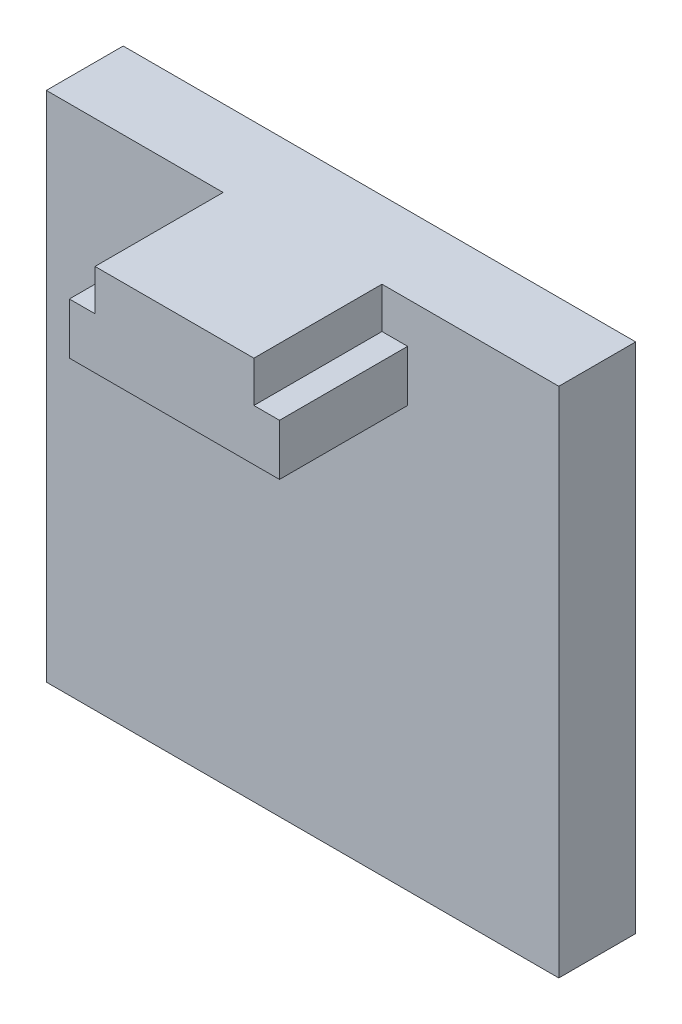
ISO-10303-21;
HEADER;
FILE_DESCRIPTION(('STEP AP214'),'2;1');
FILE_NAME('part.step','',(''),(''),'','','');
FILE_SCHEMA(('AUTOMOTIVE_DESIGN { 1 0 10303 214 1 1 1 1 }'));
ENDSEC;
DATA;
#1=APPLICATION_CONTEXT('core data for automotive mechanical design processes');
#2=APPLICATION_PROTOCOL_DEFINITION('international standard','automotive_design',2000,#1);
#3=PRODUCT_CONTEXT('',#1,'mechanical');
#4=PRODUCT('Part','Part','',(#3));
#5=PRODUCT_RELATED_PRODUCT_CATEGORY('part','',(#4));
#6=PRODUCT_DEFINITION_FORMATION('','',#4);
#7=PRODUCT_DEFINITION_CONTEXT('part definition',#1,'design');
#8=PRODUCT_DEFINITION('design','',#6,#7);
#9=PRODUCT_DEFINITION_SHAPE('','',#8);
#10=(LENGTH_UNIT() NAMED_UNIT(*) SI_UNIT(.MILLI.,.METRE.));
#11=(NAMED_UNIT(*) PLANE_ANGLE_UNIT() SI_UNIT($,.RADIAN.));
#12=(NAMED_UNIT(*) SI_UNIT($,.STERADIAN.) SOLID_ANGLE_UNIT());
#13=UNCERTAINTY_MEASURE_WITH_UNIT(LENGTH_MEASURE(1.E-05),#10,'distance_accuracy_value','');
#14=(GEOMETRIC_REPRESENTATION_CONTEXT(3) GLOBAL_UNCERTAINTY_ASSIGNED_CONTEXT((#13)) GLOBAL_UNIT_ASSIGNED_CONTEXT((#10,
#11,#12)) REPRESENTATION_CONTEXT('',''));
#15=CARTESIAN_POINT('',(0.,0.,0.));
#16=DIRECTION('',(0.,0.,1.));
#17=DIRECTION('',(1.,0.,0.));
#18=AXIS2_PLACEMENT_3D('',#15,#16,#17);
#19=CARTESIAN_POINT('',(0.,0.,3.));
#20=DIRECTION('',(0.,0.,-1.));
#21=DIRECTION('',(-1.,0.,0.));
#22=AXIS2_PLACEMENT_3D('',#19,#20,#21);
#23=PLANE('',#22);
#24=DIRECTION('',(0.,-1.,0.));
#25=VECTOR('',#24,1.);
#26=CARTESIAN_POINT('',(6.9,20.,3.));
#27=LINE('',#26,#25);
#28=CARTESIAN_POINT('',(6.9,20.,3.));
#29=VERTEX_POINT('',#28);
#30=CARTESIAN_POINT('',(6.9,18.4,3.));
#31=VERTEX_POINT('',#30);
#32=EDGE_CURVE('E213',#29,#31,#27,.T.);
#33=ORIENTED_EDGE('',*,*,#32,.F.);
#34=DIRECTION('',(-1.,0.,0.));
#35=VECTOR('',#34,1.);
#36=CARTESIAN_POINT('',(0.,20.,3.));
#37=LINE('',#36,#35);
#38=CARTESIAN_POINT('',(0.,20.,3.));
#39=VERTEX_POINT('',#38);
#40=EDGE_CURVE('E174',#29,#39,#37,.T.);
#41=ORIENTED_EDGE('',*,*,#40,.T.);
#42=DIRECTION('',(0.,-1.,0.));
#43=VECTOR('',#42,1.);
#44=CARTESIAN_POINT('',(0.,0.,3.));
#45=LINE('',#44,#43);
#46=CARTESIAN_POINT('',(0.,0.,3.));
#47=VERTEX_POINT('',#46);
#48=EDGE_CURVE('E163',#39,#47,#45,.T.);
#49=ORIENTED_EDGE('',*,*,#48,.T.);
#50=DIRECTION('',(1.,0.,0.));
#51=VECTOR('',#50,1.);
#52=CARTESIAN_POINT('',(0.,0.,3.));
#53=LINE('',#52,#51);
#54=CARTESIAN_POINT('',(20.,0.,3.));
#55=VERTEX_POINT('',#54);
#56=EDGE_CURVE('E167',#47,#55,#53,.T.);
#57=ORIENTED_EDGE('',*,*,#56,.T.);
#58=DIRECTION('',(0.,1.,0.));
#59=VECTOR('',#58,1.);
#60=CARTESIAN_POINT('',(20.,0.,3.));
#61=LINE('',#60,#59);
#62=CARTESIAN_POINT('',(20.,20.,3.));
#63=VERTEX_POINT('',#62);
#64=EDGE_CURVE('E171',#55,#63,#61,.T.);
#65=ORIENTED_EDGE('',*,*,#64,.T.);
#66=CARTESIAN_POINT('',(13.1,20.,3.));
#67=VERTEX_POINT('',#66);
#68=EDGE_CURVE('E175',#63,#67,#37,.T.);
#69=ORIENTED_EDGE('',*,*,#68,.T.);
#70=DIRECTION('',(0.,1.,0.));
#71=VECTOR('',#70,1.);
#72=CARTESIAN_POINT('',(13.1,18.4,3.));
#73=LINE('',#72,#71);
#74=CARTESIAN_POINT('',(13.1,18.4,3.));
#75=VERTEX_POINT('',#74);
#76=EDGE_CURVE('E259',#75,#67,#73,.T.);
#77=ORIENTED_EDGE('',*,*,#76,.F.);
#78=DIRECTION('',(-1.,0.,0.));
#79=VECTOR('',#78,1.);
#80=CARTESIAN_POINT('',(14.1,18.4,3.));
#81=LINE('',#80,#79);
#82=CARTESIAN_POINT('',(14.1,18.4,3.));
#83=VERTEX_POINT('',#82);
#84=EDGE_CURVE('E248',#83,#75,#81,.T.);
#85=ORIENTED_EDGE('',*,*,#84,.F.);
#86=DIRECTION('',(0.,1.,0.));
#87=VECTOR('',#86,1.);
#88=CARTESIAN_POINT('',(14.1,16.4,3.));
#89=LINE('',#88,#87);
#90=CARTESIAN_POINT('',(14.1,16.4,3.));
#91=VERTEX_POINT('',#90);
#92=EDGE_CURVE('E253',#91,#83,#89,.T.);
#93=ORIENTED_EDGE('',*,*,#92,.F.);
#94=DIRECTION('',(1.,0.,0.));
#95=VECTOR('',#94,1.);
#96=CARTESIAN_POINT('',(13.1,16.4,3.));
#97=LINE('',#96,#95);
#98=CARTESIAN_POINT('',(5.9,16.4,3.));
#99=VERTEX_POINT('',#98);
#100=EDGE_CURVE('E255',#99,#91,#97,.T.);
#101=ORIENTED_EDGE('',*,*,#100,.F.);
#102=DIRECTION('',(0.,-1.,0.));
#103=VECTOR('',#102,1.);
#104=CARTESIAN_POINT('',(5.9,18.4,3.));
#105=LINE('',#104,#103);
#106=CARTESIAN_POINT('',(5.9,18.4,3.));
#107=VERTEX_POINT('',#106);
#108=EDGE_CURVE('E60',#107,#99,#105,.T.);
#109=ORIENTED_EDGE('',*,*,#108,.F.);
#110=DIRECTION('',(-1.,0.,0.));
#111=VECTOR('',#110,1.);
#112=CARTESIAN_POINT('',(6.9,18.4,3.));
#113=LINE('',#112,#111);
#114=EDGE_CURVE('E55',#31,#107,#113,.T.);
#115=ORIENTED_EDGE('',*,*,#114,.F.);
#116=EDGE_LOOP('',(#33,#41,#49,#57,#65,#69,#77,#85,#93,#101,#109,#115));
#117=FACE_BOUND('',#116,.T.);
#118=ADVANCED_FACE('F39',(#117),#23,.F.);
#119=CARTESIAN_POINT('',(0.,0.,3.));
#120=DIRECTION('',(1.,0.,0.));
#121=DIRECTION('',(0.,0.,-1.));
#122=AXIS2_PLACEMENT_3D('',#119,#120,#121);
#123=PLANE('',#122);
#124=DIRECTION('',(0.,-1.,0.));
#125=VECTOR('',#124,1.);
#126=CARTESIAN_POINT('',(0.,0.,0.));
#127=LINE('',#126,#125);
#128=CARTESIAN_POINT('',(0.,20.,0.));
#129=VERTEX_POINT('',#128);
#130=CARTESIAN_POINT('',(0.,0.,0.));
#131=VERTEX_POINT('',#130);
#132=EDGE_CURVE('E152',#129,#131,#127,.T.);
#133=ORIENTED_EDGE('',*,*,#132,.T.);
#134=DIRECTION('',(0.,0.,-1.));
#135=VECTOR('',#134,1.);
#136=CARTESIAN_POINT('',(0.,0.,3.));
#137=LINE('',#136,#135);
#138=EDGE_CURVE('E11',#47,#131,#137,.T.);
#139=ORIENTED_EDGE('',*,*,#138,.F.);
#140=ORIENTED_EDGE('',*,*,#48,.F.);
#141=DIRECTION('',(0.,0.,-1.));
#142=VECTOR('',#141,1.);
#143=CARTESIAN_POINT('',(0.,20.,3.));
#144=LINE('',#143,#142);
#145=EDGE_CURVE('E177',#39,#129,#144,.T.);
#146=ORIENTED_EDGE('',*,*,#145,.T.);
#147=EDGE_LOOP('',(#133,#139,#140,#146));
#148=FACE_BOUND('',#147,.T.);
#149=ADVANCED_FACE('F41',(#148),#123,.F.);
#150=CARTESIAN_POINT('',(0.,0.,3.));
#151=DIRECTION('',(0.,1.,0.));
#152=DIRECTION('',(0.,0.,1.));
#153=AXIS2_PLACEMENT_3D('',#150,#151,#152);
#154=PLANE('',#153);
#155=DIRECTION('',(1.,0.,0.));
#156=VECTOR('',#155,1.);
#157=CARTESIAN_POINT('',(0.,0.,0.));
#158=LINE('',#157,#156);
#159=CARTESIAN_POINT('',(20.,0.,0.));
#160=VERTEX_POINT('',#159);
#161=EDGE_CURVE('E157',#131,#160,#158,.T.);
#162=ORIENTED_EDGE('',*,*,#161,.T.);
#163=DIRECTION('',(0.,0.,-1.));
#164=VECTOR('',#163,1.);
#165=CARTESIAN_POINT('',(20.,0.,3.));
#166=LINE('',#165,#164);
#167=EDGE_CURVE('E48',#55,#160,#166,.T.);
#168=ORIENTED_EDGE('',*,*,#167,.F.);
#169=ORIENTED_EDGE('',*,*,#56,.F.);
#170=ORIENTED_EDGE('',*,*,#138,.T.);
#171=EDGE_LOOP('',(#162,#168,#169,#170));
#172=FACE_BOUND('',#171,.T.);
#173=ADVANCED_FACE('F305',(#172),#154,.F.);
#174=CARTESIAN_POINT('',(20.,0.,3.));
#175=DIRECTION('',(-1.,0.,0.));
#176=DIRECTION('',(0.,0.,1.));
#177=AXIS2_PLACEMENT_3D('',#174,#175,#176);
#178=PLANE('',#177);
#179=DIRECTION('',(0.,1.,0.));
#180=VECTOR('',#179,1.);
#181=CARTESIAN_POINT('',(20.,0.,0.));
#182=LINE('',#181,#180);
#183=CARTESIAN_POINT('',(20.,20.,0.));
#184=VERTEX_POINT('',#183);
#185=EDGE_CURVE('E181',#160,#184,#182,.T.);
#186=ORIENTED_EDGE('',*,*,#185,.T.);
#187=DIRECTION('',(0.,0.,-1.));
#188=VECTOR('',#187,1.);
#189=CARTESIAN_POINT('',(20.,20.,3.));
#190=LINE('',#189,#188);
#191=EDGE_CURVE('E189',#63,#184,#190,.T.);
#192=ORIENTED_EDGE('',*,*,#191,.F.);
#193=ORIENTED_EDGE('',*,*,#64,.F.);
#194=ORIENTED_EDGE('',*,*,#167,.T.);
#195=EDGE_LOOP('',(#186,#192,#193,#194));
#196=FACE_BOUND('',#195,.T.);
#197=ADVANCED_FACE('F198',(#196),#178,.F.);
#198=CARTESIAN_POINT('',(0.,20.,3.));
#199=DIRECTION('',(0.,-1.,0.));
#200=DIRECTION('',(0.,0.,-1.));
#201=AXIS2_PLACEMENT_3D('',#198,#199,#200);
#202=PLANE('',#201);
#203=DIRECTION('',(-1.,0.,0.));
#204=VECTOR('',#203,1.);
#205=CARTESIAN_POINT('',(0.,20.,0.));
#206=LINE('',#205,#204);
#207=EDGE_CURVE('E168',#184,#129,#206,.T.);
#208=ORIENTED_EDGE('',*,*,#207,.T.);
#209=ORIENTED_EDGE('',*,*,#145,.F.);
#210=ORIENTED_EDGE('',*,*,#40,.F.);
#211=DIRECTION('',(0.,0.,-1.));
#212=VECTOR('',#211,1.);
#213=CARTESIAN_POINT('',(6.9,20.,8.));
#214=LINE('',#213,#212);
#215=CARTESIAN_POINT('',(6.9,20.,8.));
#216=VERTEX_POINT('',#215);
#217=EDGE_CURVE('E218',#216,#29,#214,.T.);
#218=ORIENTED_EDGE('',*,*,#217,.F.);
#219=DIRECTION('',(-1.,0.,0.));
#220=VECTOR('',#219,1.);
#221=CARTESIAN_POINT('',(6.9,20.,8.));
#222=LINE('',#221,#220);
#223=CARTESIAN_POINT('',(13.1,20.,8.));
#224=VERTEX_POINT('',#223);
#225=EDGE_CURVE('E274',#224,#216,#222,.T.);
#226=ORIENTED_EDGE('',*,*,#225,.F.);
#227=DIRECTION('',(0.,0.,-1.));
#228=VECTOR('',#227,1.);
#229=CARTESIAN_POINT('',(13.1,20.,8.));
#230=LINE('',#229,#228);
#231=EDGE_CURVE('E226',#224,#67,#230,.T.);
#232=ORIENTED_EDGE('',*,*,#231,.T.);
#233=ORIENTED_EDGE('',*,*,#68,.F.);
#234=ORIENTED_EDGE('',*,*,#191,.T.);
#235=EDGE_LOOP('',(#208,#209,#210,#218,#226,#232,#233,#234));
#236=FACE_BOUND('',#235,.T.);
#237=ADVANCED_FACE('F207',(#236),#202,.F.);
#238=CARTESIAN_POINT('',(0.,0.,0.));
#239=DIRECTION('',(0.,0.,-1.));
#240=DIRECTION('',(-1.,0.,0.));
#241=AXIS2_PLACEMENT_3D('',#238,#239,#240);
#242=PLANE('',#241);
#243=ORIENTED_EDGE('',*,*,#132,.F.);
#244=ORIENTED_EDGE('',*,*,#207,.F.);
#245=ORIENTED_EDGE('',*,*,#185,.F.);
#246=ORIENTED_EDGE('',*,*,#161,.F.);
#247=EDGE_LOOP('',(#243,#244,#245,#246));
#248=FACE_BOUND('',#247,.T.);
#249=ADVANCED_FACE('F204',(#248),#242,.T.);
#250=CARTESIAN_POINT('',(5.9,18.4,8.));
#251=DIRECTION('',(1.,0.,0.));
#252=DIRECTION('',(0.,0.,-1.));
#253=AXIS2_PLACEMENT_3D('',#250,#251,#252);
#254=PLANE('',#253);
#255=ORIENTED_EDGE('',*,*,#108,.T.);
#256=DIRECTION('',(0.,0.,-1.));
#257=VECTOR('',#256,1.);
#258=CARTESIAN_POINT('',(5.9,16.4,8.));
#259=LINE('',#258,#257);
#260=CARTESIAN_POINT('',(5.9,16.4,8.));
#261=VERTEX_POINT('',#260);
#262=EDGE_CURVE('E132',#261,#99,#259,.T.);
#263=ORIENTED_EDGE('',*,*,#262,.F.);
#264=DIRECTION('',(0.,-1.,0.));
#265=VECTOR('',#264,1.);
#266=CARTESIAN_POINT('',(5.9,18.4,8.));
#267=LINE('',#266,#265);
#268=CARTESIAN_POINT('',(5.9,18.4,8.));
#269=VERTEX_POINT('',#268);
#270=EDGE_CURVE('E139',#269,#261,#267,.T.);
#271=ORIENTED_EDGE('',*,*,#270,.F.);
#272=DIRECTION('',(0.,0.,-1.));
#273=VECTOR('',#272,1.);
#274=CARTESIAN_POINT('',(5.9,18.4,8.));
#275=LINE('',#274,#273);
#276=EDGE_CURVE('E234',#269,#107,#275,.T.);
#277=ORIENTED_EDGE('',*,*,#276,.T.);
#278=EDGE_LOOP('',(#255,#263,#271,#277));
#279=FACE_BOUND('',#278,.T.);
#280=ADVANCED_FACE('F150',(#279),#254,.F.);
#281=CARTESIAN_POINT('',(13.1,16.4,8.));
#282=DIRECTION('',(0.,1.,0.));
#283=DIRECTION('',(0.,0.,1.));
#284=AXIS2_PLACEMENT_3D('',#281,#282,#283);
#285=PLANE('',#284);
#286=ORIENTED_EDGE('',*,*,#100,.T.);
#287=DIRECTION('',(0.,0.,-1.));
#288=VECTOR('',#287,1.);
#289=CARTESIAN_POINT('',(14.1,16.4,8.));
#290=LINE('',#289,#288);
#291=CARTESIAN_POINT('',(14.1,16.4,8.));
#292=VERTEX_POINT('',#291);
#293=EDGE_CURVE('E134',#292,#91,#290,.T.);
#294=ORIENTED_EDGE('',*,*,#293,.F.);
#295=DIRECTION('',(1.,0.,0.));
#296=VECTOR('',#295,1.);
#297=CARTESIAN_POINT('',(5.9,16.4,8.));
#298=LINE('',#297,#296);
#299=EDGE_CURVE('E127',#261,#292,#298,.T.);
#300=ORIENTED_EDGE('',*,*,#299,.F.);
#301=ORIENTED_EDGE('',*,*,#262,.T.);
#302=EDGE_LOOP('',(#286,#294,#300,#301));
#303=FACE_BOUND('',#302,.T.);
#304=ADVANCED_FACE('F130',(#303),#285,.F.);
#305=CARTESIAN_POINT('',(14.1,16.4,8.));
#306=DIRECTION('',(-1.,0.,0.));
#307=DIRECTION('',(0.,0.,1.));
#308=AXIS2_PLACEMENT_3D('',#305,#306,#307);
#309=PLANE('',#308);
#310=ORIENTED_EDGE('',*,*,#92,.T.);
#311=DIRECTION('',(0.,0.,-1.));
#312=VECTOR('',#311,1.);
#313=CARTESIAN_POINT('',(14.1,18.4,8.));
#314=LINE('',#313,#312);
#315=CARTESIAN_POINT('',(14.1,18.4,8.));
#316=VERTEX_POINT('',#315);
#317=EDGE_CURVE('E159',#316,#83,#314,.T.);
#318=ORIENTED_EDGE('',*,*,#317,.F.);
#319=DIRECTION('',(0.,1.,0.));
#320=VECTOR('',#319,1.);
#321=CARTESIAN_POINT('',(14.1,16.4,8.));
#322=LINE('',#321,#320);
#323=EDGE_CURVE('E138',#292,#316,#322,.T.);
#324=ORIENTED_EDGE('',*,*,#323,.F.);
#325=ORIENTED_EDGE('',*,*,#293,.T.);
#326=EDGE_LOOP('',(#310,#318,#324,#325));
#327=FACE_BOUND('',#326,.T.);
#328=ADVANCED_FACE('F252',(#327),#309,.F.);
#329=CARTESIAN_POINT('',(14.1,18.4,8.));
#330=DIRECTION('',(0.,-1.,0.));
#331=DIRECTION('',(0.,0.,-1.));
#332=AXIS2_PLACEMENT_3D('',#329,#330,#331);
#333=PLANE('',#332);
#334=ORIENTED_EDGE('',*,*,#84,.T.);
#335=DIRECTION('',(0.,0.,-1.));
#336=VECTOR('',#335,1.);
#337=CARTESIAN_POINT('',(13.1,18.4,8.));
#338=LINE('',#337,#336);
#339=CARTESIAN_POINT('',(13.1,18.4,8.));
#340=VERTEX_POINT('',#339);
#341=EDGE_CURVE('E232',#340,#75,#338,.T.);
#342=ORIENTED_EDGE('',*,*,#341,.F.);
#343=DIRECTION('',(-1.,0.,0.));
#344=VECTOR('',#343,1.);
#345=CARTESIAN_POINT('',(14.1,18.4,8.));
#346=LINE('',#345,#344);
#347=EDGE_CURVE('E249',#316,#340,#346,.T.);
#348=ORIENTED_EDGE('',*,*,#347,.F.);
#349=ORIENTED_EDGE('',*,*,#317,.T.);
#350=EDGE_LOOP('',(#334,#342,#348,#349));
#351=FACE_BOUND('',#350,.T.);
#352=ADVANCED_FACE('F246',(#351),#333,.F.);
#353=CARTESIAN_POINT('',(13.1,18.4,8.));
#354=DIRECTION('',(-1.,0.,0.));
#355=DIRECTION('',(0.,0.,1.));
#356=AXIS2_PLACEMENT_3D('',#353,#354,#355);
#357=PLANE('',#356);
#358=ORIENTED_EDGE('',*,*,#76,.T.);
#359=ORIENTED_EDGE('',*,*,#231,.F.);
#360=DIRECTION('',(0.,1.,0.));
#361=VECTOR('',#360,1.);
#362=CARTESIAN_POINT('',(13.1,18.4,8.));
#363=LINE('',#362,#361);
#364=EDGE_CURVE('E280',#340,#224,#363,.T.);
#365=ORIENTED_EDGE('',*,*,#364,.F.);
#366=ORIENTED_EDGE('',*,*,#341,.T.);
#367=EDGE_LOOP('',(#358,#359,#365,#366));
#368=FACE_BOUND('',#367,.T.);
#369=ADVANCED_FACE('F289',(#368),#357,.F.);
#370=CARTESIAN_POINT('',(6.9,20.,8.));
#371=DIRECTION('',(1.,0.,0.));
#372=DIRECTION('',(0.,0.,-1.));
#373=AXIS2_PLACEMENT_3D('',#370,#371,#372);
#374=PLANE('',#373);
#375=ORIENTED_EDGE('',*,*,#32,.T.);
#376=DIRECTION('',(0.,0.,-1.));
#377=VECTOR('',#376,1.);
#378=CARTESIAN_POINT('',(6.9,18.4,8.));
#379=LINE('',#378,#377);
#380=CARTESIAN_POINT('',(6.9,18.4,8.));
#381=VERTEX_POINT('',#380);
#382=EDGE_CURVE('E227',#381,#31,#379,.T.);
#383=ORIENTED_EDGE('',*,*,#382,.F.);
#384=DIRECTION('',(0.,-1.,0.));
#385=VECTOR('',#384,1.);
#386=CARTESIAN_POINT('',(6.9,20.,8.));
#387=LINE('',#386,#385);
#388=EDGE_CURVE('E224',#216,#381,#387,.T.);
#389=ORIENTED_EDGE('',*,*,#388,.F.);
#390=ORIENTED_EDGE('',*,*,#217,.T.);
#391=EDGE_LOOP('',(#375,#383,#389,#390));
#392=FACE_BOUND('',#391,.T.);
#393=ADVANCED_FACE('F221',(#392),#374,.F.);
#394=CARTESIAN_POINT('',(6.9,18.4,8.));
#395=DIRECTION('',(0.,-1.,0.));
#396=DIRECTION('',(0.,0.,-1.));
#397=AXIS2_PLACEMENT_3D('',#394,#395,#396);
#398=PLANE('',#397);
#399=ORIENTED_EDGE('',*,*,#114,.T.);
#400=ORIENTED_EDGE('',*,*,#276,.F.);
#401=DIRECTION('',(-1.,0.,0.));
#402=VECTOR('',#401,1.);
#403=CARTESIAN_POINT('',(6.9,18.4,8.));
#404=LINE('',#403,#402);
#405=EDGE_CURVE('E144',#381,#269,#404,.T.);
#406=ORIENTED_EDGE('',*,*,#405,.F.);
#407=ORIENTED_EDGE('',*,*,#382,.T.);
#408=EDGE_LOOP('',(#399,#400,#406,#407));
#409=FACE_BOUND('',#408,.T.);
#410=ADVANCED_FACE('F291',(#409),#398,.F.);
#411=CARTESIAN_POINT('',(0.,0.,8.));
#412=DIRECTION('',(0.,0.,1.));
#413=DIRECTION('',(1.,0.,0.));
#414=AXIS2_PLACEMENT_3D('',#411,#412,#413);
#415=PLANE('',#414);
#416=ORIENTED_EDGE('',*,*,#270,.T.);
#417=ORIENTED_EDGE('',*,*,#299,.T.);
#418=ORIENTED_EDGE('',*,*,#323,.T.);
#419=ORIENTED_EDGE('',*,*,#347,.T.);
#420=ORIENTED_EDGE('',*,*,#364,.T.);
#421=ORIENTED_EDGE('',*,*,#225,.T.);
#422=ORIENTED_EDGE('',*,*,#388,.T.);
#423=ORIENTED_EDGE('',*,*,#405,.T.);
#424=EDGE_LOOP('',(#416,#417,#418,#419,#420,#421,#422,#423));
#425=FACE_BOUND('',#424,.T.);
#426=ADVANCED_FACE('F142',(#425),#415,.T.);
#427=CLOSED_SHELL('',(#118,#149,#173,#197,#237,#249,#280,#304,#328,#352,#369,#393,#410,#426));
#428=MANIFOLD_SOLID_BREP('B2',#427);
#429=ADVANCED_BREP_SHAPE_REPRESENTATION('',(#18,#428),#14);
#430=SHAPE_DEFINITION_REPRESENTATION(#9,#429);
ENDSEC;
END-ISO-10303-21;
